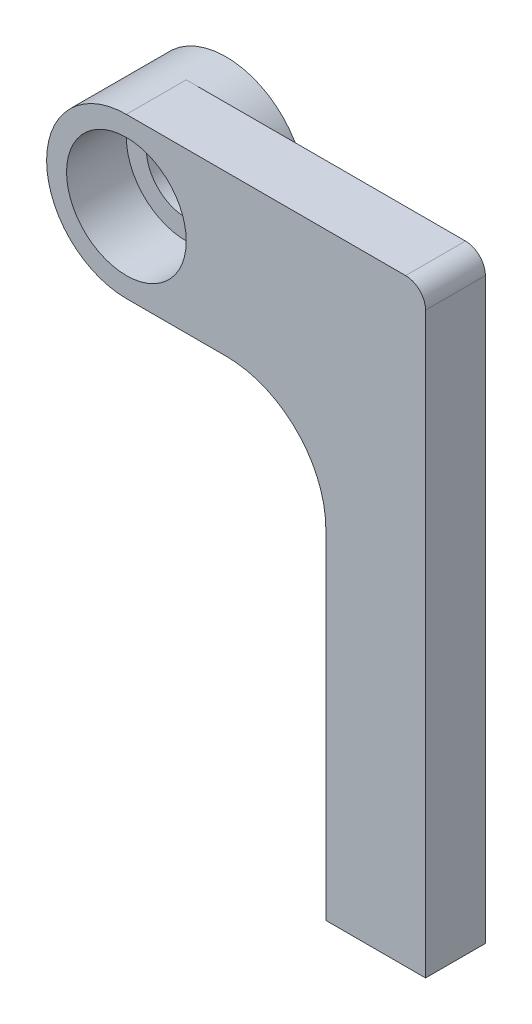
ISO-10303-21;
HEADER;
FILE_DESCRIPTION(('STEP AP214'),'2;1');
FILE_NAME('part.step','',(''),(''),'','','');
FILE_SCHEMA(('AUTOMOTIVE_DESIGN { 1 0 10303 214 1 1 1 1 }'));
ENDSEC;
DATA;
#1=APPLICATION_CONTEXT('core data for automotive mechanical design processes');
#2=APPLICATION_PROTOCOL_DEFINITION('international standard','automotive_design',2000,#1);
#3=PRODUCT_CONTEXT('',#1,'mechanical');
#4=PRODUCT('Part','Part','',(#3));
#5=PRODUCT_RELATED_PRODUCT_CATEGORY('part','',(#4));
#6=PRODUCT_DEFINITION_FORMATION('','',#4);
#7=PRODUCT_DEFINITION_CONTEXT('part definition',#1,'design');
#8=PRODUCT_DEFINITION('design','',#6,#7);
#9=PRODUCT_DEFINITION_SHAPE('','',#8);
#10=(LENGTH_UNIT() NAMED_UNIT(*) SI_UNIT(.MILLI.,.METRE.));
#11=(NAMED_UNIT(*) PLANE_ANGLE_UNIT() SI_UNIT($,.RADIAN.));
#12=(NAMED_UNIT(*) SI_UNIT($,.STERADIAN.) SOLID_ANGLE_UNIT());
#13=UNCERTAINTY_MEASURE_WITH_UNIT(LENGTH_MEASURE(1.E-05),#10,'distance_accuracy_value','');
#14=(GEOMETRIC_REPRESENTATION_CONTEXT(3) GLOBAL_UNCERTAINTY_ASSIGNED_CONTEXT((#13)) GLOBAL_UNIT_ASSIGNED_CONTEXT((#10,
#11,#12)) REPRESENTATION_CONTEXT('',''));
#15=CARTESIAN_POINT('',(0.,0.,0.));
#16=DIRECTION('',(0.,0.,1.));
#17=DIRECTION('',(1.,0.,0.));
#18=AXIS2_PLACEMENT_3D('',#15,#16,#17);
#19=CARTESIAN_POINT('',(0.,0.,0.));
#20=DIRECTION('',(0.,0.,1.));
#21=DIRECTION('',(1.,0.,0.));
#22=AXIS2_PLACEMENT_3D('',#19,#20,#21);
#23=PLANE('',#22);
#24=CARTESIAN_POINT('',(0.,0.,0.));
#25=DIRECTION('',(0.,0.,-1.));
#26=DIRECTION('',(-1.,0.,0.));
#27=AXIS2_PLACEMENT_3D('',#24,#25,#26);
#28=CIRCLE('',#27,4.);
#29=CARTESIAN_POINT('',(0.,4.,0.));
#30=VERTEX_POINT('',#29);
#31=CARTESIAN_POINT('',(0.,-4.,0.));
#32=VERTEX_POINT('',#31);
#33=EDGE_CURVE('E96',#30,#32,#28,.T.);
#34=ORIENTED_EDGE('',*,*,#33,.F.);
#35=DIRECTION('',(1.,0.,0.));
#36=VECTOR('',#35,1.);
#37=CARTESIAN_POINT('',(0.,4.,0.));
#38=LINE('',#37,#36);
#39=CARTESIAN_POINT('',(14.,4.,0.));
#40=VERTEX_POINT('',#39);
#41=EDGE_CURVE('E99',#30,#40,#38,.T.);
#42=ORIENTED_EDGE('',*,*,#41,.T.);
#43=CARTESIAN_POINT('',(14.,3.,0.));
#44=DIRECTION('',(0.,0.,1.));
#45=DIRECTION('',(1.,0.,0.));
#46=AXIS2_PLACEMENT_3D('',#43,#44,#45);
#47=CIRCLE('',#46,1.);
#48=CARTESIAN_POINT('',(15.,3.,0.));
#49=VERTEX_POINT('',#48);
#50=EDGE_CURVE('E57',#40,#49,#47,.F.);
#51=ORIENTED_EDGE('',*,*,#50,.T.);
#52=DIRECTION('',(0.,-1.,0.));
#53=VECTOR('',#52,1.);
#54=CARTESIAN_POINT('',(15.,4.,0.));
#55=LINE('',#54,#53);
#56=CARTESIAN_POINT('',(15.,-26.,0.));
#57=VERTEX_POINT('',#56);
#58=EDGE_CURVE('E124',#49,#57,#55,.T.);
#59=ORIENTED_EDGE('',*,*,#58,.T.);
#60=DIRECTION('',(1.,0.,0.));
#61=VECTOR('',#60,1.);
#62=CARTESIAN_POINT('',(10.,-26.,0.));
#63=LINE('',#62,#61);
#64=CARTESIAN_POINT('',(10.,-26.,0.));
#65=VERTEX_POINT('',#64);
#66=EDGE_CURVE('E128',#65,#57,#63,.T.);
#67=ORIENTED_EDGE('',*,*,#66,.F.);
#68=DIRECTION('',(0.,-1.,0.));
#69=VECTOR('',#68,1.);
#70=CARTESIAN_POINT('',(10.,-4.,0.));
#71=LINE('',#70,#69);
#72=CARTESIAN_POINT('',(10.,-9.,0.));
#73=VERTEX_POINT('',#72);
#74=EDGE_CURVE('E168',#73,#65,#71,.T.);
#75=ORIENTED_EDGE('',*,*,#74,.F.);
#76=CARTESIAN_POINT('',(5.00000000000001,-9.,0.));
#77=DIRECTION('',(0.,0.,1.));
#78=DIRECTION('',(1.,0.,0.));
#79=AXIS2_PLACEMENT_3D('',#76,#77,#78);
#80=CIRCLE('',#79,5.);
#81=CARTESIAN_POINT('',(5.00000000000001,-4.,0.));
#82=VERTEX_POINT('',#81);
#83=EDGE_CURVE('E144',#73,#82,#80,.T.);
#84=ORIENTED_EDGE('',*,*,#83,.T.);
#85=DIRECTION('',(1.,0.,0.));
#86=VECTOR('',#85,1.);
#87=CARTESIAN_POINT('',(0.,-4.,0.));
#88=LINE('',#87,#86);
#89=EDGE_CURVE('E101',#32,#82,#88,.T.);
#90=ORIENTED_EDGE('',*,*,#89,.F.);
#91=EDGE_LOOP('',(#34,#42,#51,#59,#67,#75,#84,#90));
#92=FACE_BOUND('',#91,.T.);
#93=ADVANCED_FACE('F35',(#92),#23,.F.);
#94=CARTESIAN_POINT('',(0.,0.,3.));
#95=DIRECTION('',(0.,0.,-1.));
#96=DIRECTION('',(-1.,0.,0.));
#97=AXIS2_PLACEMENT_3D('',#94,#95,#96);
#98=CYLINDRICAL_SURFACE('',#97,4.);
#99=DIRECTION('',(0.,0.,-1.));
#100=VECTOR('',#99,1.);
#101=CARTESIAN_POINT('',(0.,4.,3.));
#102=LINE('',#101,#100);
#103=CARTESIAN_POINT('',(0.,4.,3.));
#104=VERTEX_POINT('',#103);
#105=EDGE_CURVE('E110',#104,#30,#102,.T.);
#106=ORIENTED_EDGE('',*,*,#105,.T.);
#107=ORIENTED_EDGE('',*,*,#33,.T.);
#108=DIRECTION('',(0.,0.,-1.));
#109=VECTOR('',#108,1.);
#110=CARTESIAN_POINT('',(0.,-4.,3.));
#111=LINE('',#110,#109);
#112=CARTESIAN_POINT('',(0.,-4.,3.));
#113=VERTEX_POINT('',#112);
#114=EDGE_CURVE('E137',#113,#32,#111,.T.);
#115=ORIENTED_EDGE('',*,*,#114,.F.);
#116=CARTESIAN_POINT('',(0.,0.,3.));
#117=DIRECTION('',(0.,0.,1.));
#118=DIRECTION('',(1.,0.,0.));
#119=AXIS2_PLACEMENT_3D('',#116,#117,#118);
#120=CIRCLE('',#119,4.);
#121=EDGE_CURVE('E114',#104,#113,#120,.T.);
#122=ORIENTED_EDGE('',*,*,#121,.F.);
#123=EDGE_LOOP('',(#106,#107,#115,#122));
#124=FACE_BOUND('',#123,.T.);
#125=CARTESIAN_POINT('',(0.,0.,-2.));
#126=DIRECTION('',(0.,0.,-1.));
#127=DIRECTION('',(-1.,0.,0.));
#128=AXIS2_PLACEMENT_3D('',#125,#126,#127);
#129=CIRCLE('',#128,4.);
#130=CARTESIAN_POINT('',(-4.,0.,-2.));
#131=VERTEX_POINT('',#130);
#132=EDGE_CURVE('E105',#131,#131,#129,.T.);
#133=ORIENTED_EDGE('',*,*,#132,.F.);
#134=EDGE_LOOP('',(#133));
#135=FACE_BOUND('',#134,.T.);
#136=ADVANCED_FACE('F111',(#124,#135),#98,.T.);
#137=CARTESIAN_POINT('',(0.,-4.,3.));
#138=DIRECTION('',(0.,1.,0.));
#139=DIRECTION('',(0.,0.,1.));
#140=AXIS2_PLACEMENT_3D('',#137,#138,#139);
#141=PLANE('',#140);
#142=ORIENTED_EDGE('',*,*,#89,.T.);
#143=DIRECTION('',(0.,0.,-1.));
#144=VECTOR('',#143,1.);
#145=CARTESIAN_POINT('',(5.00000000000001,-4.,3.));
#146=LINE('',#145,#144);
#147=CARTESIAN_POINT('',(5.00000000000001,-4.,3.));
#148=VERTEX_POINT('',#147);
#149=EDGE_CURVE('E142',#82,#148,#146,.F.);
#150=ORIENTED_EDGE('',*,*,#149,.T.);
#151=DIRECTION('',(1.,0.,0.));
#152=VECTOR('',#151,1.);
#153=CARTESIAN_POINT('',(0.,-4.,3.));
#154=LINE('',#153,#152);
#155=EDGE_CURVE('E126',#113,#148,#154,.T.);
#156=ORIENTED_EDGE('',*,*,#155,.F.);
#157=ORIENTED_EDGE('',*,*,#114,.T.);
#158=EDGE_LOOP('',(#142,#150,#156,#157));
#159=FACE_BOUND('',#158,.T.);
#160=ADVANCED_FACE('F170',(#159),#141,.F.);
#161=CARTESIAN_POINT('',(10.,-4.,3.));
#162=DIRECTION('',(1.,0.,0.));
#163=DIRECTION('',(0.,1.,0.));
#164=AXIS2_PLACEMENT_3D('',#161,#162,#163);
#165=PLANE('',#164);
#166=DIRECTION('',(0.,-1.,0.));
#167=VECTOR('',#166,1.);
#168=CARTESIAN_POINT('',(10.,-4.,3.));
#169=LINE('',#168,#167);
#170=CARTESIAN_POINT('',(10.,-9.,3.));
#171=VERTEX_POINT('',#170);
#172=CARTESIAN_POINT('',(10.,-26.,3.));
#173=VERTEX_POINT('',#172);
#174=EDGE_CURVE('E155',#171,#173,#169,.T.);
#175=ORIENTED_EDGE('',*,*,#174,.F.);
#176=DIRECTION('',(0.,0.,-1.));
#177=VECTOR('',#176,1.);
#178=CARTESIAN_POINT('',(10.,-9.,0.));
#179=LINE('',#178,#177);
#180=EDGE_CURVE('E139',#171,#73,#179,.T.);
#181=ORIENTED_EDGE('',*,*,#180,.T.);
#182=ORIENTED_EDGE('',*,*,#74,.T.);
#183=DIRECTION('',(0.,0.,-1.));
#184=VECTOR('',#183,1.);
#185=CARTESIAN_POINT('',(10.,-26.,3.));
#186=LINE('',#185,#184);
#187=EDGE_CURVE('E134',#173,#65,#186,.T.);
#188=ORIENTED_EDGE('',*,*,#187,.F.);
#189=EDGE_LOOP('',(#175,#181,#182,#188));
#190=FACE_BOUND('',#189,.T.);
#191=ADVANCED_FACE('F161',(#190),#165,.F.);
#192=CARTESIAN_POINT('',(10.,-26.,3.));
#193=DIRECTION('',(0.,1.,0.));
#194=DIRECTION('',(-1.,0.,0.));
#195=AXIS2_PLACEMENT_3D('',#192,#193,#194);
#196=PLANE('',#195);
#197=ORIENTED_EDGE('',*,*,#66,.T.);
#198=DIRECTION('',(0.,0.,-1.));
#199=VECTOR('',#198,1.);
#200=CARTESIAN_POINT('',(15.,-26.,3.));
#201=LINE('',#200,#199);
#202=CARTESIAN_POINT('',(15.,-26.,3.));
#203=VERTEX_POINT('',#202);
#204=EDGE_CURVE('E117',#203,#57,#201,.T.);
#205=ORIENTED_EDGE('',*,*,#204,.F.);
#206=DIRECTION('',(1.,0.,0.));
#207=VECTOR('',#206,1.);
#208=CARTESIAN_POINT('',(10.,-26.,3.));
#209=LINE('',#208,#207);
#210=EDGE_CURVE('E164',#173,#203,#209,.T.);
#211=ORIENTED_EDGE('',*,*,#210,.F.);
#212=ORIENTED_EDGE('',*,*,#187,.T.);
#213=EDGE_LOOP('',(#197,#205,#211,#212));
#214=FACE_BOUND('',#213,.T.);
#215=ADVANCED_FACE('F182',(#214),#196,.F.);
#216=CARTESIAN_POINT('',(15.,4.,3.));
#217=DIRECTION('',(1.,0.,0.));
#218=DIRECTION('',(0.,1.,0.));
#219=AXIS2_PLACEMENT_3D('',#216,#217,#218);
#220=PLANE('',#219);
#221=ORIENTED_EDGE('',*,*,#58,.F.);
#222=DIRECTION('',(0.,0.,-1.));
#223=VECTOR('',#222,1.);
#224=CARTESIAN_POINT('',(15.,3.,3.));
#225=LINE('',#224,#223);
#226=CARTESIAN_POINT('',(15.,3.,3.));
#227=VERTEX_POINT('',#226);
#228=EDGE_CURVE('E43',#49,#227,#225,.F.);
#229=ORIENTED_EDGE('',*,*,#228,.T.);
#230=DIRECTION('',(0.,-1.,0.));
#231=VECTOR('',#230,1.);
#232=CARTESIAN_POINT('',(15.,4.,3.));
#233=LINE('',#232,#231);
#234=EDGE_CURVE('E184',#227,#203,#233,.T.);
#235=ORIENTED_EDGE('',*,*,#234,.T.);
#236=ORIENTED_EDGE('',*,*,#204,.T.);
#237=EDGE_LOOP('',(#221,#229,#235,#236));
#238=FACE_BOUND('',#237,.T.);
#239=ADVANCED_FACE('F183',(#238),#220,.T.);
#240=CARTESIAN_POINT('',(0.,4.,3.));
#241=DIRECTION('',(0.,1.,0.));
#242=DIRECTION('',(0.,0.,1.));
#243=AXIS2_PLACEMENT_3D('',#240,#241,#242);
#244=PLANE('',#243);
#245=DIRECTION('',(1.,0.,0.));
#246=VECTOR('',#245,1.);
#247=CARTESIAN_POINT('',(10.,4.,3.));
#248=LINE('',#247,#246);
#249=CARTESIAN_POINT('',(14.,4.,3.));
#250=VERTEX_POINT('',#249);
#251=EDGE_CURVE('E118',#104,#250,#248,.T.);
#252=ORIENTED_EDGE('',*,*,#251,.T.);
#253=DIRECTION('',(0.,0.,-1.));
#254=VECTOR('',#253,1.);
#255=CARTESIAN_POINT('',(14.,4.,3.));
#256=LINE('',#255,#254);
#257=EDGE_CURVE('E123',#250,#40,#256,.T.);
#258=ORIENTED_EDGE('',*,*,#257,.T.);
#259=ORIENTED_EDGE('',*,*,#41,.F.);
#260=ORIENTED_EDGE('',*,*,#105,.F.);
#261=EDGE_LOOP('',(#252,#258,#259,#260));
#262=FACE_BOUND('',#261,.T.);
#263=ADVANCED_FACE('F121',(#262),#244,.T.);
#264=CARTESIAN_POINT('',(0.,0.,3.));
#265=DIRECTION('',(0.,0.,1.));
#266=DIRECTION('',(1.,0.,0.));
#267=AXIS2_PLACEMENT_3D('',#264,#265,#266);
#268=PLANE('',#267);
#269=CARTESIAN_POINT('',(0.,0.,3.));
#270=DIRECTION('',(0.,0.,1.));
#271=DIRECTION('',(1.,0.,0.));
#272=AXIS2_PLACEMENT_3D('',#269,#270,#271);
#273=CIRCLE('',#272,3.);
#274=CARTESIAN_POINT('',(3.,0.,3.));
#275=VERTEX_POINT('',#274);
#276=EDGE_CURVE('E171',#275,#275,#273,.T.);
#277=ORIENTED_EDGE('',*,*,#276,.F.);
#278=EDGE_LOOP('',(#277));
#279=FACE_BOUND('',#278,.T.);
#280=ORIENTED_EDGE('',*,*,#234,.F.);
#281=CARTESIAN_POINT('',(14.,3.,3.));
#282=DIRECTION('',(0.,0.,1.));
#283=DIRECTION('',(1.,0.,0.));
#284=AXIS2_PLACEMENT_3D('',#281,#282,#283);
#285=CIRCLE('',#284,1.);
#286=EDGE_CURVE('E11',#227,#250,#285,.T.);
#287=ORIENTED_EDGE('',*,*,#286,.T.);
#288=ORIENTED_EDGE('',*,*,#251,.F.);
#289=ORIENTED_EDGE('',*,*,#121,.T.);
#290=ORIENTED_EDGE('',*,*,#155,.T.);
#291=CARTESIAN_POINT('',(5.00000000000001,-9.,3.));
#292=DIRECTION('',(0.,0.,1.));
#293=DIRECTION('',(1.,0.,0.));
#294=AXIS2_PLACEMENT_3D('',#291,#292,#293);
#295=CIRCLE('',#294,5.);
#296=EDGE_CURVE('E146',#148,#171,#295,.F.);
#297=ORIENTED_EDGE('',*,*,#296,.T.);
#298=ORIENTED_EDGE('',*,*,#174,.T.);
#299=ORIENTED_EDGE('',*,*,#210,.T.);
#300=EDGE_LOOP('',(#280,#287,#288,#289,#290,#297,#298,#299));
#301=FACE_BOUND('',#300,.T.);
#302=ADVANCED_FACE('F153',(#279,#301),#268,.T.);
#303=CARTESIAN_POINT('',(0.,0.,5.));
#304=DIRECTION('',(0.,0.,-1.));
#305=DIRECTION('',(-1.,0.,0.));
#306=AXIS2_PLACEMENT_3D('',#303,#304,#305);
#307=CYLINDRICAL_SURFACE('',#306,3.);
#308=ORIENTED_EDGE('',*,*,#276,.T.);
#309=EDGE_LOOP('',(#308));
#310=FACE_BOUND('',#309,.T.);
#311=CARTESIAN_POINT('',(0.,0.,0.));
#312=DIRECTION('',(0.,0.,-1.));
#313=DIRECTION('',(-1.,0.,0.));
#314=AXIS2_PLACEMENT_3D('',#311,#312,#313);
#315=CIRCLE('',#314,3.);
#316=CARTESIAN_POINT('',(-3.,0.,0.));
#317=VERTEX_POINT('',#316);
#318=EDGE_CURVE('E175',#317,#317,#315,.T.);
#319=ORIENTED_EDGE('',*,*,#318,.T.);
#320=EDGE_LOOP('',(#319));
#321=FACE_BOUND('',#320,.T.);
#322=ADVANCED_FACE('F234',(#310,#321),#307,.F.);
#323=CARTESIAN_POINT('',(5.00000000000001,-9.,3.));
#324=DIRECTION('',(0.,0.,1.));
#325=DIRECTION('',(1.,0.,0.));
#326=AXIS2_PLACEMENT_3D('',#323,#324,#325);
#327=CYLINDRICAL_SURFACE('',#326,5.);
#328=ORIENTED_EDGE('',*,*,#296,.F.);
#329=ORIENTED_EDGE('',*,*,#149,.F.);
#330=ORIENTED_EDGE('',*,*,#83,.F.);
#331=ORIENTED_EDGE('',*,*,#180,.F.);
#332=EDGE_LOOP('',(#328,#329,#330,#331));
#333=FACE_BOUND('',#332,.T.);
#334=ADVANCED_FACE('F166',(#333),#327,.F.);
#335=CARTESIAN_POINT('',(14.,3.,3.));
#336=DIRECTION('',(0.,0.,-1.));
#337=DIRECTION('',(-1.,0.,0.));
#338=AXIS2_PLACEMENT_3D('',#335,#336,#337);
#339=CYLINDRICAL_SURFACE('',#338,1.);
#340=ORIENTED_EDGE('',*,*,#286,.F.);
#341=ORIENTED_EDGE('',*,*,#228,.F.);
#342=ORIENTED_EDGE('',*,*,#50,.F.);
#343=ORIENTED_EDGE('',*,*,#257,.F.);
#344=EDGE_LOOP('',(#340,#341,#342,#343));
#345=FACE_BOUND('',#344,.T.);
#346=ADVANCED_FACE('F37',(#345),#339,.T.);
#347=CARTESIAN_POINT('',(0.,0.,-2.));
#348=DIRECTION('',(0.,0.,-1.));
#349=DIRECTION('',(-1.,0.,0.));
#350=AXIS2_PLACEMENT_3D('',#347,#348,#349);
#351=PLANE('',#350);
#352=ORIENTED_EDGE('',*,*,#132,.T.);
#353=EDGE_LOOP('',(#352));
#354=FACE_BOUND('',#353,.T.);
#355=CARTESIAN_POINT('',(0.,0.,-2.));
#356=DIRECTION('',(0.,0.,-1.));
#357=DIRECTION('',(-1.,0.,0.));
#358=AXIS2_PLACEMENT_3D('',#355,#356,#357);
#359=CIRCLE('',#358,2.);
#360=CARTESIAN_POINT('',(-2.,0.,-2.));
#361=VERTEX_POINT('',#360);
#362=EDGE_CURVE('E106',#361,#361,#359,.T.);
#363=ORIENTED_EDGE('',*,*,#362,.F.);
#364=EDGE_LOOP('',(#363));
#365=FACE_BOUND('',#364,.T.);
#366=ADVANCED_FACE('F202',(#354,#365),#351,.T.);
#367=CARTESIAN_POINT('',(0.,0.,0.));
#368=DIRECTION('',(0.,0.,-1.));
#369=DIRECTION('',(-1.,0.,0.));
#370=AXIS2_PLACEMENT_3D('',#367,#368,#369);
#371=PLANE('',#370);
#372=ORIENTED_EDGE('',*,*,#318,.F.);
#373=EDGE_LOOP('',(#372));
#374=FACE_BOUND('',#373,.T.);
#375=CARTESIAN_POINT('',(0.,0.,0.));
#376=DIRECTION('',(0.,0.,-1.));
#377=DIRECTION('',(-1.,0.,0.));
#378=AXIS2_PLACEMENT_3D('',#375,#376,#377);
#379=CIRCLE('',#378,2.);
#380=CARTESIAN_POINT('',(-2.,0.,0.));
#381=VERTEX_POINT('',#380);
#382=EDGE_CURVE('E193',#381,#381,#379,.T.);
#383=ORIENTED_EDGE('',*,*,#382,.T.);
#384=EDGE_LOOP('',(#383));
#385=FACE_BOUND('',#384,.T.);
#386=ADVANCED_FACE('F204',(#374,#385),#371,.F.);
#387=CARTESIAN_POINT('',(0.,0.,-2.));
#388=DIRECTION('',(0.,0.,1.));
#389=DIRECTION('',(1.,0.,0.));
#390=AXIS2_PLACEMENT_3D('',#387,#388,#389);
#391=CYLINDRICAL_SURFACE('',#390,2.);
#392=ORIENTED_EDGE('',*,*,#362,.T.);
#393=EDGE_LOOP('',(#392));
#394=FACE_BOUND('',#393,.T.);
#395=ORIENTED_EDGE('',*,*,#382,.F.);
#396=EDGE_LOOP('',(#395));
#397=FACE_BOUND('',#396,.T.);
#398=ADVANCED_FACE('F199',(#394,#397),#391,.F.);
#399=CLOSED_SHELL('',(#93,#136,#160,#191,#215,#239,#263,#302,#322,#334,#346,#366,#386,#398));
#400=MANIFOLD_SOLID_BREP('B2',#399);
#401=ADVANCED_BREP_SHAPE_REPRESENTATION('',(#18,#400),#14);
#402=SHAPE_DEFINITION_REPRESENTATION(#9,#401);
ENDSEC;
END-ISO-10303-21;
